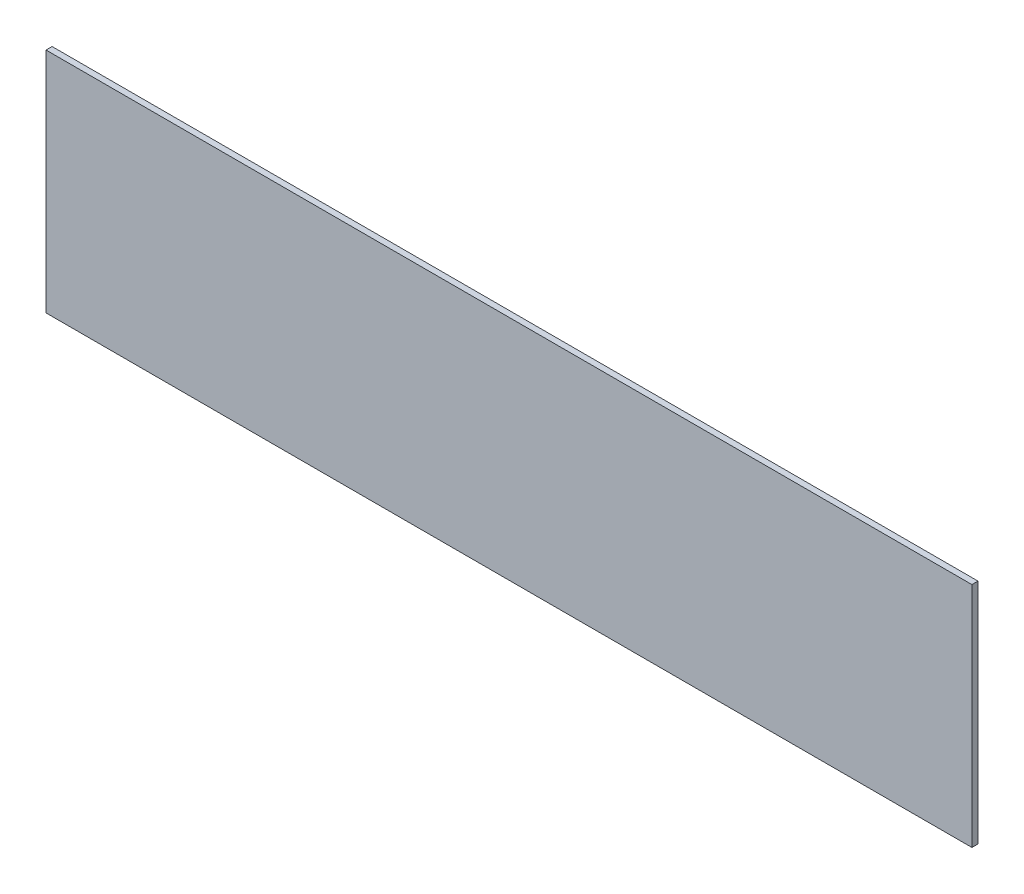
ISO-10303-21;
HEADER;
FILE_DESCRIPTION(('STEP AP214'),'2;1');
FILE_NAME('part.step','',(''),(''),'','','');
FILE_SCHEMA(('AUTOMOTIVE_DESIGN { 1 0 10303 214 1 1 1 1 }'));
ENDSEC;
DATA;
#1=APPLICATION_CONTEXT('core data for automotive mechanical design processes');
#2=APPLICATION_PROTOCOL_DEFINITION('international standard','automotive_design',2000,#1);
#3=PRODUCT_CONTEXT('',#1,'mechanical');
#4=PRODUCT('Part','Part','',(#3));
#5=PRODUCT_RELATED_PRODUCT_CATEGORY('part','',(#4));
#6=PRODUCT_DEFINITION_FORMATION('','',#4);
#7=PRODUCT_DEFINITION_CONTEXT('part definition',#1,'design');
#8=PRODUCT_DEFINITION('design','',#6,#7);
#9=PRODUCT_DEFINITION_SHAPE('','',#8);
#10=(LENGTH_UNIT() NAMED_UNIT(*) SI_UNIT(.MILLI.,.METRE.));
#11=(NAMED_UNIT(*) PLANE_ANGLE_UNIT() SI_UNIT($,.RADIAN.));
#12=(NAMED_UNIT(*) SI_UNIT($,.STERADIAN.) SOLID_ANGLE_UNIT());
#13=UNCERTAINTY_MEASURE_WITH_UNIT(LENGTH_MEASURE(1.E-05),#10,'distance_accuracy_value','');
#14=(GEOMETRIC_REPRESENTATION_CONTEXT(3) GLOBAL_UNCERTAINTY_ASSIGNED_CONTEXT((#13)) GLOBAL_UNIT_ASSIGNED_CONTEXT((#10,
#11,#12)) REPRESENTATION_CONTEXT('',''));
#15=CARTESIAN_POINT('',(0.,0.,0.));
#16=DIRECTION('',(0.,0.,1.));
#17=DIRECTION('',(1.,0.,0.));
#18=AXIS2_PLACEMENT_3D('',#15,#16,#17);
#19=CARTESIAN_POINT('',(305.,-75.,4.));
#20=DIRECTION('',(-1.,0.,0.));
#21=DIRECTION('',(0.,0.,1.));
#22=AXIS2_PLACEMENT_3D('',#19,#20,#21);
#23=PLANE('',#22);
#24=DIRECTION('',(0.,1.,0.));
#25=VECTOR('',#24,1.);
#26=CARTESIAN_POINT('',(305.,-75.,0.));
#27=LINE('',#26,#25);
#28=CARTESIAN_POINT('',(305.,-75.,0.));
#29=VERTEX_POINT('',#28);
#30=CARTESIAN_POINT('',(305.,75.,0.));
#31=VERTEX_POINT('',#30);
#32=EDGE_CURVE('E107',#29,#31,#27,.T.);
#33=ORIENTED_EDGE('',*,*,#32,.T.);
#34=DIRECTION('',(0.,0.,-1.));
#35=VECTOR('',#34,1.);
#36=CARTESIAN_POINT('',(305.,75.,4.));
#37=LINE('',#36,#35);
#38=CARTESIAN_POINT('',(305.,75.,4.));
#39=VERTEX_POINT('',#38);
#40=EDGE_CURVE('E11',#39,#31,#37,.T.);
#41=ORIENTED_EDGE('',*,*,#40,.F.);
#42=DIRECTION('',(0.,1.,0.));
#43=VECTOR('',#42,1.);
#44=CARTESIAN_POINT('',(305.,-75.,4.));
#45=LINE('',#44,#43);
#46=CARTESIAN_POINT('',(305.,-75.,4.));
#47=VERTEX_POINT('',#46);
#48=EDGE_CURVE('E91',#47,#39,#45,.T.);
#49=ORIENTED_EDGE('',*,*,#48,.F.);
#50=DIRECTION('',(0.,0.,-1.));
#51=VECTOR('',#50,1.);
#52=CARTESIAN_POINT('',(305.,-75.,4.));
#53=LINE('',#52,#51);
#54=EDGE_CURVE('E103',#47,#29,#53,.T.);
#55=ORIENTED_EDGE('',*,*,#54,.T.);
#56=EDGE_LOOP('',(#33,#41,#49,#55));
#57=FACE_BOUND('',#56,.T.);
#58=ADVANCED_FACE('F39',(#57),#23,.F.);
#59=CARTESIAN_POINT('',(-305.,75.,4.));
#60=DIRECTION('',(0.,-1.,0.));
#61=DIRECTION('',(0.,0.,-1.));
#62=AXIS2_PLACEMENT_3D('',#59,#60,#61);
#63=PLANE('',#62);
#64=DIRECTION('',(-1.,0.,0.));
#65=VECTOR('',#64,1.);
#66=CARTESIAN_POINT('',(-305.,75.,0.));
#67=LINE('',#66,#65);
#68=CARTESIAN_POINT('',(-305.,75.,0.));
#69=VERTEX_POINT('',#68);
#70=EDGE_CURVE('E96',#31,#69,#67,.T.);
#71=ORIENTED_EDGE('',*,*,#70,.T.);
#72=DIRECTION('',(0.,0.,-1.));
#73=VECTOR('',#72,1.);
#74=CARTESIAN_POINT('',(-305.,75.,4.));
#75=LINE('',#74,#73);
#76=CARTESIAN_POINT('',(-305.,75.,4.));
#77=VERTEX_POINT('',#76);
#78=EDGE_CURVE('E48',#77,#69,#75,.T.);
#79=ORIENTED_EDGE('',*,*,#78,.F.);
#80=DIRECTION('',(-1.,0.,0.));
#81=VECTOR('',#80,1.);
#82=CARTESIAN_POINT('',(-305.,75.,4.));
#83=LINE('',#82,#81);
#84=EDGE_CURVE('E86',#39,#77,#83,.T.);
#85=ORIENTED_EDGE('',*,*,#84,.F.);
#86=ORIENTED_EDGE('',*,*,#40,.T.);
#87=EDGE_LOOP('',(#71,#79,#85,#86));
#88=FACE_BOUND('',#87,.T.);
#89=ADVANCED_FACE('F95',(#88),#63,.F.);
#90=CARTESIAN_POINT('',(-305.,-75.,4.));
#91=DIRECTION('',(1.,0.,0.));
#92=DIRECTION('',(0.,0.,-1.));
#93=AXIS2_PLACEMENT_3D('',#90,#91,#92);
#94=PLANE('',#93);
#95=DIRECTION('',(0.,-1.,0.));
#96=VECTOR('',#95,1.);
#97=CARTESIAN_POINT('',(-305.,-75.,0.));
#98=LINE('',#97,#96);
#99=CARTESIAN_POINT('',(-305.,-75.,0.));
#100=VERTEX_POINT('',#99);
#101=EDGE_CURVE('E73',#69,#100,#98,.T.);
#102=ORIENTED_EDGE('',*,*,#101,.T.);
#103=DIRECTION('',(0.,0.,-1.));
#104=VECTOR('',#103,1.);
#105=CARTESIAN_POINT('',(-305.,-75.,4.));
#106=LINE('',#105,#104);
#107=CARTESIAN_POINT('',(-305.,-75.,4.));
#108=VERTEX_POINT('',#107);
#109=EDGE_CURVE('E98',#108,#100,#106,.T.);
#110=ORIENTED_EDGE('',*,*,#109,.F.);
#111=DIRECTION('',(0.,-1.,0.));
#112=VECTOR('',#111,1.);
#113=CARTESIAN_POINT('',(-305.,-75.,4.));
#114=LINE('',#113,#112);
#115=EDGE_CURVE('E89',#77,#108,#114,.T.);
#116=ORIENTED_EDGE('',*,*,#115,.F.);
#117=ORIENTED_EDGE('',*,*,#78,.T.);
#118=EDGE_LOOP('',(#102,#110,#116,#117));
#119=FACE_BOUND('',#118,.T.);
#120=ADVANCED_FACE('F99',(#119),#94,.F.);
#121=CARTESIAN_POINT('',(-305.,-75.,4.));
#122=DIRECTION('',(0.,1.,0.));
#123=DIRECTION('',(0.,0.,1.));
#124=AXIS2_PLACEMENT_3D('',#121,#122,#123);
#125=PLANE('',#124);
#126=DIRECTION('',(1.,0.,0.));
#127=VECTOR('',#126,1.);
#128=CARTESIAN_POINT('',(-305.,-75.,0.));
#129=LINE('',#128,#127);
#130=EDGE_CURVE('E79',#100,#29,#129,.T.);
#131=ORIENTED_EDGE('',*,*,#130,.T.);
#132=ORIENTED_EDGE('',*,*,#54,.F.);
#133=DIRECTION('',(1.,0.,0.));
#134=VECTOR('',#133,1.);
#135=CARTESIAN_POINT('',(-305.,-75.,4.));
#136=LINE('',#135,#134);
#137=EDGE_CURVE('E56',#108,#47,#136,.T.);
#138=ORIENTED_EDGE('',*,*,#137,.F.);
#139=ORIENTED_EDGE('',*,*,#109,.T.);
#140=EDGE_LOOP('',(#131,#132,#138,#139));
#141=FACE_BOUND('',#140,.T.);
#142=ADVANCED_FACE('F120',(#141),#125,.F.);
#143=CARTESIAN_POINT('',(0.,0.,4.));
#144=DIRECTION('',(0.,0.,-1.));
#145=DIRECTION('',(-1.,0.,0.));
#146=AXIS2_PLACEMENT_3D('',#143,#144,#145);
#147=PLANE('',#146);
#148=ORIENTED_EDGE('',*,*,#48,.T.);
#149=ORIENTED_EDGE('',*,*,#84,.T.);
#150=ORIENTED_EDGE('',*,*,#115,.T.);
#151=ORIENTED_EDGE('',*,*,#137,.T.);
#152=EDGE_LOOP('',(#148,#149,#150,#151));
#153=FACE_BOUND('',#152,.T.);
#154=ADVANCED_FACE('F87',(#153),#147,.F.);
#155=CARTESIAN_POINT('',(0.,0.,0.));
#156=DIRECTION('',(0.,0.,-1.));
#157=DIRECTION('',(-1.,0.,0.));
#158=AXIS2_PLACEMENT_3D('',#155,#156,#157);
#159=PLANE('',#158);
#160=ORIENTED_EDGE('',*,*,#32,.F.);
#161=ORIENTED_EDGE('',*,*,#130,.F.);
#162=ORIENTED_EDGE('',*,*,#101,.F.);
#163=ORIENTED_EDGE('',*,*,#70,.F.);
#164=EDGE_LOOP('',(#160,#161,#162,#163));
#165=FACE_BOUND('',#164,.T.);
#166=ADVANCED_FACE('F123',(#165),#159,.T.);
#167=CLOSED_SHELL('',(#58,#89,#120,#142,#154,#166));
#168=MANIFOLD_SOLID_BREP('B2',#167);
#169=ADVANCED_BREP_SHAPE_REPRESENTATION('',(#18,#168),#14);
#170=SHAPE_DEFINITION_REPRESENTATION(#9,#169);
ENDSEC;
END-ISO-10303-21;
